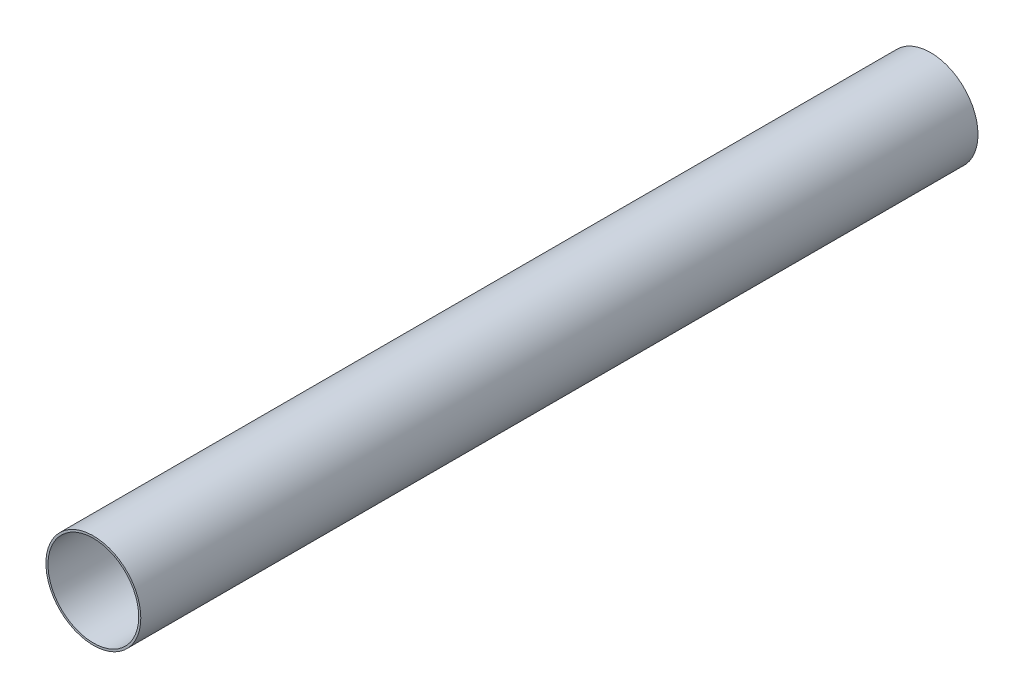
ISO-10303-21;
HEADER;
FILE_DESCRIPTION(('STEP AP214'),'2;1');
FILE_NAME('part.step','',(''),(''),'','','');
FILE_SCHEMA(('AUTOMOTIVE_DESIGN { 1 0 10303 214 1 1 1 1 }'));
ENDSEC;
DATA;
#1=APPLICATION_CONTEXT('core data for automotive mechanical design processes');
#2=APPLICATION_PROTOCOL_DEFINITION('international standard','automotive_design',2000,#1);
#3=PRODUCT_CONTEXT('',#1,'mechanical');
#4=PRODUCT('Part','Part','',(#3));
#5=PRODUCT_RELATED_PRODUCT_CATEGORY('part','',(#4));
#6=PRODUCT_DEFINITION_FORMATION('','',#4);
#7=PRODUCT_DEFINITION_CONTEXT('part definition',#1,'design');
#8=PRODUCT_DEFINITION('design','',#6,#7);
#9=PRODUCT_DEFINITION_SHAPE('','',#8);
#10=(LENGTH_UNIT() NAMED_UNIT(*) SI_UNIT(.MILLI.,.METRE.));
#11=(NAMED_UNIT(*) PLANE_ANGLE_UNIT() SI_UNIT($,.RADIAN.));
#12=(NAMED_UNIT(*) SI_UNIT($,.STERADIAN.) SOLID_ANGLE_UNIT());
#13=UNCERTAINTY_MEASURE_WITH_UNIT(LENGTH_MEASURE(1.E-05),#10,'distance_accuracy_value','');
#14=(GEOMETRIC_REPRESENTATION_CONTEXT(3) GLOBAL_UNCERTAINTY_ASSIGNED_CONTEXT((#13)) GLOBAL_UNIT_ASSIGNED_CONTEXT((#10,
#11,#12)) REPRESENTATION_CONTEXT('',''));
#15=CARTESIAN_POINT('',(0.,0.,0.));
#16=DIRECTION('',(0.,0.,1.));
#17=DIRECTION('',(1.,0.,0.));
#18=AXIS2_PLACEMENT_3D('',#15,#16,#17);
#19=CARTESIAN_POINT('',(0.,0.,914.4));
#20=DIRECTION('',(0.,0.,1.));
#21=DIRECTION('',(1.,0.,0.));
#22=AXIS2_PLACEMENT_3D('',#19,#20,#21);
#23=PLANE('',#22);
#24=CARTESIAN_POINT('',(0.,0.,914.4));
#25=DIRECTION('',(0.,0.,1.));
#26=DIRECTION('',(1.,0.,0.));
#27=AXIS2_PLACEMENT_3D('',#24,#25,#26);
#28=CIRCLE('',#27,51.816);
#29=CARTESIAN_POINT('',(51.816,0.,914.4));
#30=VERTEX_POINT('',#29);
#31=EDGE_CURVE('E10',#30,#30,#28,.T.);
#32=ORIENTED_EDGE('',*,*,#31,.T.);
#33=EDGE_LOOP('',(#32));
#34=FACE_BOUND('',#33,.T.);
#35=CARTESIAN_POINT('',(0.,0.,914.4));
#36=DIRECTION('',(0.,0.,1.));
#37=DIRECTION('',(1.,0.,0.));
#38=AXIS2_PLACEMENT_3D('',#35,#36,#37);
#39=CIRCLE('',#38,49.5554);
#40=CARTESIAN_POINT('',(49.5554,0.,914.4));
#41=VERTEX_POINT('',#40);
#42=EDGE_CURVE('E52',#41,#41,#39,.T.);
#43=ORIENTED_EDGE('',*,*,#42,.F.);
#44=EDGE_LOOP('',(#43));
#45=FACE_BOUND('',#44,.T.);
#46=ADVANCED_FACE('F41',(#34,#45),#23,.T.);
#47=CARTESIAN_POINT('',(0.,0.,0.));
#48=DIRECTION('',(0.,0.,1.));
#49=DIRECTION('',(1.,0.,0.));
#50=AXIS2_PLACEMENT_3D('',#47,#48,#49);
#51=PLANE('',#50);
#52=CARTESIAN_POINT('',(0.,0.,0.));
#53=DIRECTION('',(0.,0.,1.));
#54=DIRECTION('',(1.,0.,0.));
#55=AXIS2_PLACEMENT_3D('',#52,#53,#54);
#56=CIRCLE('',#55,51.816);
#57=CARTESIAN_POINT('',(51.816,0.,0.));
#58=VERTEX_POINT('',#57);
#59=EDGE_CURVE('E45',#58,#58,#56,.T.);
#60=ORIENTED_EDGE('',*,*,#59,.F.);
#61=EDGE_LOOP('',(#60));
#62=FACE_BOUND('',#61,.T.);
#63=CARTESIAN_POINT('',(0.,0.,0.));
#64=DIRECTION('',(0.,0.,1.));
#65=DIRECTION('',(1.,0.,0.));
#66=AXIS2_PLACEMENT_3D('',#63,#64,#65);
#67=CIRCLE('',#66,49.5554);
#68=CARTESIAN_POINT('',(49.5554,0.,0.));
#69=VERTEX_POINT('',#68);
#70=EDGE_CURVE('E54',#69,#69,#67,.T.);
#71=ORIENTED_EDGE('',*,*,#70,.T.);
#72=EDGE_LOOP('',(#71));
#73=FACE_BOUND('',#72,.T.);
#74=ADVANCED_FACE('F64',(#62,#73),#51,.F.);
#75=CARTESIAN_POINT('',(0.,0.,914.4));
#76=DIRECTION('',(0.,0.,-1.));
#77=DIRECTION('',(-1.,0.,0.));
#78=AXIS2_PLACEMENT_3D('',#75,#76,#77);
#79=CYLINDRICAL_SURFACE('',#78,51.816);
#80=ORIENTED_EDGE('',*,*,#31,.F.);
#81=EDGE_LOOP('',(#80));
#82=FACE_BOUND('',#81,.T.);
#83=ORIENTED_EDGE('',*,*,#59,.T.);
#84=EDGE_LOOP('',(#83));
#85=FACE_BOUND('',#84,.T.);
#86=ADVANCED_FACE('F43',(#82,#85),#79,.T.);
#87=CARTESIAN_POINT('',(0.,0.,914.4));
#88=DIRECTION('',(0.,0.,-1.));
#89=DIRECTION('',(-1.,0.,0.));
#90=AXIS2_PLACEMENT_3D('',#87,#88,#89);
#91=CYLINDRICAL_SURFACE('',#90,49.5554);
#92=ORIENTED_EDGE('',*,*,#42,.T.);
#93=EDGE_LOOP('',(#92));
#94=FACE_BOUND('',#93,.T.);
#95=ORIENTED_EDGE('',*,*,#70,.F.);
#96=EDGE_LOOP('',(#95));
#97=FACE_BOUND('',#96,.T.);
#98=ADVANCED_FACE('F60',(#94,#97),#91,.F.);
#99=CLOSED_SHELL('',(#46,#74,#86,#98));
#100=MANIFOLD_SOLID_BREP('B2',#99);
#101=ADVANCED_BREP_SHAPE_REPRESENTATION('',(#18,#100),#14);
#102=SHAPE_DEFINITION_REPRESENTATION(#9,#101);
ENDSEC;
END-ISO-10303-21;
